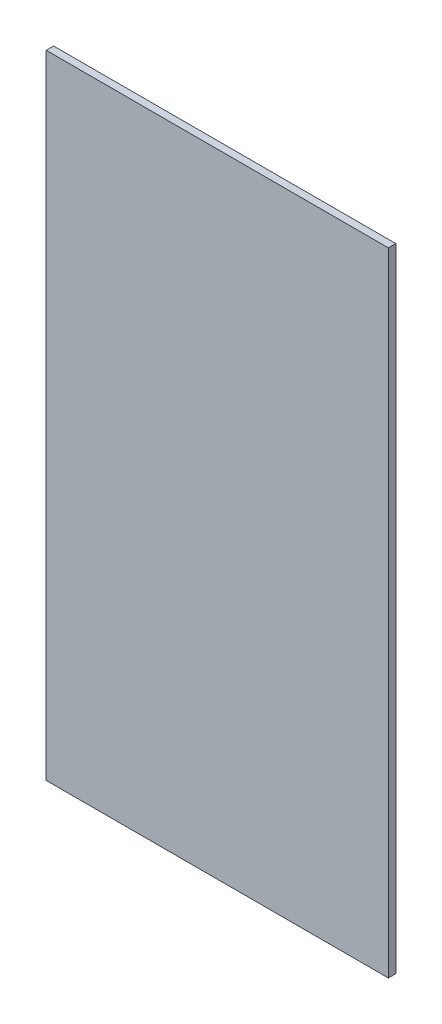
ISO-10303-21;
HEADER;
FILE_DESCRIPTION(('STEP AP214'),'2;1');
FILE_NAME('part.step','',(''),(''),'','','');
FILE_SCHEMA(('AUTOMOTIVE_DESIGN { 1 0 10303 214 1 1 1 1 }'));
ENDSEC;
DATA;
#1=APPLICATION_CONTEXT('core data for automotive mechanical design processes');
#2=APPLICATION_PROTOCOL_DEFINITION('international standard','automotive_design',2000,#1);
#3=PRODUCT_CONTEXT('',#1,'mechanical');
#4=PRODUCT('Part','Part','',(#3));
#5=PRODUCT_RELATED_PRODUCT_CATEGORY('part','',(#4));
#6=PRODUCT_DEFINITION_FORMATION('','',#4);
#7=PRODUCT_DEFINITION_CONTEXT('part definition',#1,'design');
#8=PRODUCT_DEFINITION('design','',#6,#7);
#9=PRODUCT_DEFINITION_SHAPE('','',#8);
#10=(LENGTH_UNIT() NAMED_UNIT(*) SI_UNIT(.MILLI.,.METRE.));
#11=(NAMED_UNIT(*) PLANE_ANGLE_UNIT() SI_UNIT($,.RADIAN.));
#12=(NAMED_UNIT(*) SI_UNIT($,.STERADIAN.) SOLID_ANGLE_UNIT());
#13=UNCERTAINTY_MEASURE_WITH_UNIT(LENGTH_MEASURE(1.E-05),#10,'distance_accuracy_value','');
#14=(GEOMETRIC_REPRESENTATION_CONTEXT(3) GLOBAL_UNCERTAINTY_ASSIGNED_CONTEXT((#13)) GLOBAL_UNIT_ASSIGNED_CONTEXT((#10,
#11,#12)) REPRESENTATION_CONTEXT('',''));
#15=CARTESIAN_POINT('',(0.,0.,0.));
#16=DIRECTION('',(0.,0.,1.));
#17=DIRECTION('',(1.,0.,0.));
#18=AXIS2_PLACEMENT_3D('',#15,#16,#17);
#19=CARTESIAN_POINT('',(115.,217.5,5.));
#20=DIRECTION('',(0.,-1.,0.));
#21=DIRECTION('',(0.,0.,-1.));
#22=AXIS2_PLACEMENT_3D('',#19,#20,#21);
#23=PLANE('',#22);
#24=DIRECTION('',(-1.,0.,0.));
#25=VECTOR('',#24,1.);
#26=CARTESIAN_POINT('',(115.,217.5,0.));
#27=LINE('',#26,#25);
#28=CARTESIAN_POINT('',(115.,217.5,0.));
#29=VERTEX_POINT('',#28);
#30=CARTESIAN_POINT('',(-115.,217.5,0.));
#31=VERTEX_POINT('',#30);
#32=EDGE_CURVE('E143',#29,#31,#27,.T.);
#33=ORIENTED_EDGE('',*,*,#32,.T.);
#34=DIRECTION('',(0.,0.,-1.));
#35=VECTOR('',#34,1.);
#36=CARTESIAN_POINT('',(-115.,217.5,5.));
#37=LINE('',#36,#35);
#38=CARTESIAN_POINT('',(-115.,217.5,5.));
#39=VERTEX_POINT('',#38);
#40=EDGE_CURVE('E12',#39,#31,#37,.T.);
#41=ORIENTED_EDGE('',*,*,#40,.F.);
#42=DIRECTION('',(-1.,0.,0.));
#43=VECTOR('',#42,1.);
#44=CARTESIAN_POINT('',(115.,217.5,5.));
#45=LINE('',#44,#43);
#46=CARTESIAN_POINT('',(115.,217.5,5.));
#47=VERTEX_POINT('',#46);
#48=EDGE_CURVE('E94',#47,#39,#45,.T.);
#49=ORIENTED_EDGE('',*,*,#48,.F.);
#50=DIRECTION('',(0.,0.,-1.));
#51=VECTOR('',#50,1.);
#52=CARTESIAN_POINT('',(115.,217.5,5.));
#53=LINE('',#52,#51);
#54=EDGE_CURVE('E106',#47,#29,#53,.T.);
#55=ORIENTED_EDGE('',*,*,#54,.T.);
#56=EDGE_LOOP('',(#33,#41,#49,#55));
#57=FACE_BOUND('',#56,.T.);
#58=ADVANCED_FACE('F41',(#57),#23,.F.);
#59=CARTESIAN_POINT('',(-115.,217.5,5.));
#60=DIRECTION('',(1.,0.,0.));
#61=DIRECTION('',(0.,1.,0.));
#62=AXIS2_PLACEMENT_3D('',#59,#60,#61);
#63=PLANE('',#62);
#64=DIRECTION('',(0.,-1.,0.));
#65=VECTOR('',#64,1.);
#66=CARTESIAN_POINT('',(-115.,217.5,0.));
#67=LINE('',#66,#65);
#68=CARTESIAN_POINT('',(-115.,-207.5,0.));
#69=VERTEX_POINT('',#68);
#70=EDGE_CURVE('E99',#31,#69,#67,.T.);
#71=ORIENTED_EDGE('',*,*,#70,.T.);
#72=DIRECTION('',(0.,0.,-1.));
#73=VECTOR('',#72,1.);
#74=CARTESIAN_POINT('',(-115.,-207.5,5.));
#75=LINE('',#74,#73);
#76=CARTESIAN_POINT('',(-115.,-207.5,5.));
#77=VERTEX_POINT('',#76);
#78=EDGE_CURVE('E51',#77,#69,#75,.T.);
#79=ORIENTED_EDGE('',*,*,#78,.F.);
#80=DIRECTION('',(0.,-1.,0.));
#81=VECTOR('',#80,1.);
#82=CARTESIAN_POINT('',(-115.,217.5,5.));
#83=LINE('',#82,#81);
#84=EDGE_CURVE('E89',#39,#77,#83,.T.);
#85=ORIENTED_EDGE('',*,*,#84,.F.);
#86=ORIENTED_EDGE('',*,*,#40,.T.);
#87=EDGE_LOOP('',(#71,#79,#85,#86));
#88=FACE_BOUND('',#87,.T.);
#89=ADVANCED_FACE('F98',(#88),#63,.F.);
#90=CARTESIAN_POINT('',(-115.,-207.5,5.));
#91=DIRECTION('',(0.,1.,0.));
#92=DIRECTION('',(0.,0.,1.));
#93=AXIS2_PLACEMENT_3D('',#90,#91,#92);
#94=PLANE('',#93);
#95=DIRECTION('',(1.,0.,0.));
#96=VECTOR('',#95,1.);
#97=CARTESIAN_POINT('',(-115.,-207.5,0.));
#98=LINE('',#97,#96);
#99=CARTESIAN_POINT('',(115.,-207.5,0.));
#100=VERTEX_POINT('',#99);
#101=EDGE_CURVE('E76',#69,#100,#98,.T.);
#102=ORIENTED_EDGE('',*,*,#101,.T.);
#103=DIRECTION('',(0.,0.,-1.));
#104=VECTOR('',#103,1.);
#105=CARTESIAN_POINT('',(115.,-207.5,5.));
#106=LINE('',#105,#104);
#107=CARTESIAN_POINT('',(115.,-207.5,5.));
#108=VERTEX_POINT('',#107);
#109=EDGE_CURVE('E101',#108,#100,#106,.T.);
#110=ORIENTED_EDGE('',*,*,#109,.F.);
#111=DIRECTION('',(1.,0.,0.));
#112=VECTOR('',#111,1.);
#113=CARTESIAN_POINT('',(-115.,-207.5,5.));
#114=LINE('',#113,#112);
#115=EDGE_CURVE('E92',#77,#108,#114,.T.);
#116=ORIENTED_EDGE('',*,*,#115,.F.);
#117=ORIENTED_EDGE('',*,*,#78,.T.);
#118=EDGE_LOOP('',(#102,#110,#116,#117));
#119=FACE_BOUND('',#118,.T.);
#120=ADVANCED_FACE('F102',(#119),#94,.F.);
#121=CARTESIAN_POINT('',(115.,-207.5,5.));
#122=DIRECTION('',(-1.,0.,0.));
#123=DIRECTION('',(0.,0.,1.));
#124=AXIS2_PLACEMENT_3D('',#121,#122,#123);
#125=PLANE('',#124);
#126=DIRECTION('',(0.,1.,0.));
#127=VECTOR('',#126,1.);
#128=CARTESIAN_POINT('',(115.,-207.5,0.));
#129=LINE('',#128,#127);
#130=EDGE_CURVE('E82',#100,#29,#129,.T.);
#131=ORIENTED_EDGE('',*,*,#130,.T.);
#132=ORIENTED_EDGE('',*,*,#54,.F.);
#133=DIRECTION('',(0.,1.,0.));
#134=VECTOR('',#133,1.);
#135=CARTESIAN_POINT('',(115.,-207.5,5.));
#136=LINE('',#135,#134);
#137=EDGE_CURVE('E59',#108,#47,#136,.T.);
#138=ORIENTED_EDGE('',*,*,#137,.F.);
#139=ORIENTED_EDGE('',*,*,#109,.T.);
#140=EDGE_LOOP('',(#131,#132,#138,#139));
#141=FACE_BOUND('',#140,.T.);
#142=ADVANCED_FACE('F138',(#141),#125,.F.);
#143=CARTESIAN_POINT('',(0.,0.,5.));
#144=DIRECTION('',(0.,0.,1.));
#145=DIRECTION('',(1.,0.,0.));
#146=AXIS2_PLACEMENT_3D('',#143,#144,#145);
#147=PLANE('',#146);
#148=ORIENTED_EDGE('',*,*,#48,.T.);
#149=ORIENTED_EDGE('',*,*,#84,.T.);
#150=ORIENTED_EDGE('',*,*,#115,.T.);
#151=ORIENTED_EDGE('',*,*,#137,.T.);
#152=EDGE_LOOP('',(#148,#149,#150,#151));
#153=FACE_BOUND('',#152,.T.);
#154=ADVANCED_FACE('F90',(#153),#147,.T.);
#155=CARTESIAN_POINT('',(0.,0.,0.));
#156=DIRECTION('',(0.,0.,1.));
#157=DIRECTION('',(1.,0.,0.));
#158=AXIS2_PLACEMENT_3D('',#155,#156,#157);
#159=PLANE('',#158);
#160=ORIENTED_EDGE('',*,*,#32,.F.);
#161=ORIENTED_EDGE('',*,*,#130,.F.);
#162=ORIENTED_EDGE('',*,*,#101,.F.);
#163=ORIENTED_EDGE('',*,*,#70,.F.);
#164=EDGE_LOOP('',(#160,#161,#162,#163));
#165=FACE_BOUND('',#164,.T.);
#166=ADVANCED_FACE('F141',(#165),#159,.F.);
#167=CLOSED_SHELL('',(#58,#89,#120,#142,#154,#166));
#168=MANIFOLD_SOLID_BREP('B2',#167);
#169=ADVANCED_BREP_SHAPE_REPRESENTATION('',(#18,#168),#14);
#170=SHAPE_DEFINITION_REPRESENTATION(#9,#169);
ENDSEC;
END-ISO-10303-21;
